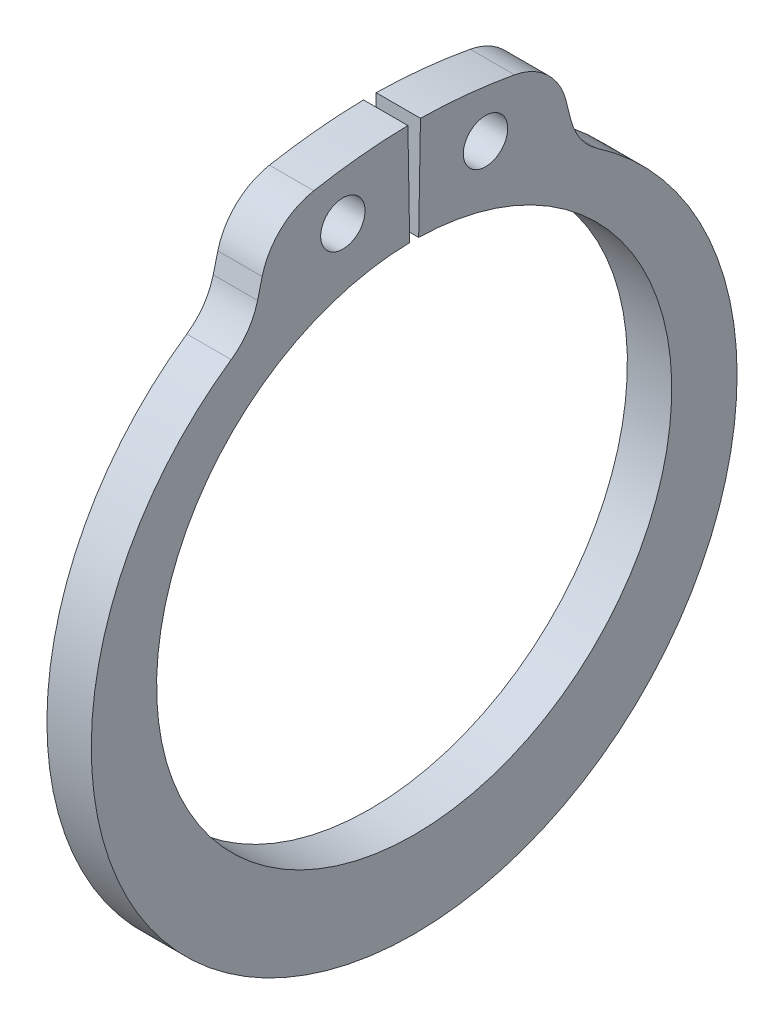
ISO-10303-21;
HEADER;
FILE_DESCRIPTION(('STEP AP214'),'2;1');
FILE_NAME('part.step','',(''),(''),'','','');
FILE_SCHEMA(('AUTOMOTIVE_DESIGN { 1 0 10303 214 1 1 1 1 }'));
ENDSEC;
DATA;
#1=APPLICATION_CONTEXT('core data for automotive mechanical design processes');
#2=APPLICATION_PROTOCOL_DEFINITION('international standard','automotive_design',2000,#1);
#3=PRODUCT_CONTEXT('',#1,'mechanical');
#4=PRODUCT('Part','Part','',(#3));
#5=PRODUCT_RELATED_PRODUCT_CATEGORY('part','',(#4));
#6=PRODUCT_DEFINITION_FORMATION('','',#4);
#7=PRODUCT_DEFINITION_CONTEXT('part definition',#1,'design');
#8=PRODUCT_DEFINITION('design','',#6,#7);
#9=PRODUCT_DEFINITION_SHAPE('','',#8);
#10=(LENGTH_UNIT() NAMED_UNIT(*) SI_UNIT(.MILLI.,.METRE.));
#11=(NAMED_UNIT(*) PLANE_ANGLE_UNIT() SI_UNIT($,.RADIAN.));
#12=(NAMED_UNIT(*) SI_UNIT($,.STERADIAN.) SOLID_ANGLE_UNIT());
#13=UNCERTAINTY_MEASURE_WITH_UNIT(LENGTH_MEASURE(1.E-05),#10,'distance_accuracy_value','');
#14=(GEOMETRIC_REPRESENTATION_CONTEXT(3) GLOBAL_UNCERTAINTY_ASSIGNED_CONTEXT((#13)) GLOBAL_UNIT_ASSIGNED_CONTEXT((#10,
#11,#12)) REPRESENTATION_CONTEXT('',''));
#15=CARTESIAN_POINT('',(0.,0.,0.));
#16=DIRECTION('',(0.,0.,1.));
#17=DIRECTION('',(1.,0.,0.));
#18=AXIS2_PLACEMENT_3D('',#15,#16,#17);
#19=CARTESIAN_POINT('',(0.9906,0.,0.));
#20=DIRECTION('',(1.,0.,0.));
#21=DIRECTION('',(0.,0.,-1.));
#22=AXIS2_PLACEMENT_3D('',#19,#20,#21);
#23=PLANE('',#22);
#24=CARTESIAN_POINT('',(0.9906,13.7386956694485,3.18562375031583));
#25=DIRECTION('',(1.,0.,0.));
#26=DIRECTION('',(0.,0.,-1.));
#27=AXIS2_PLACEMENT_3D('',#24,#25,#26);
#28=CIRCLE('',#27,0.9906);
#29=CARTESIAN_POINT('',(0.9906,13.7386956694485,2.19502375031583));
#30=VERTEX_POINT('',#29);
#31=EDGE_CURVE('E276',#30,#30,#28,.T.);
#32=ORIENTED_EDGE('',*,*,#31,.F.);
#33=EDGE_LOOP('',(#32));
#34=FACE_BOUND('',#33,.T.);
#35=CARTESIAN_POINT('',(0.9906,-9.62190277241611,-0.167950937625521));
#36=DIRECTION('',(1.,0.,0.));
#37=DIRECTION('',(0.,0.,-1.));
#38=AXIS2_PLACEMENT_3D('',#35,#36,#37);
#39=CIRCLE('',#38,25.7015684580441);
#40=CARTESIAN_POINT('',(0.9906,16.0757512122635,0.280603281179932));
#41=VERTEX_POINT('',#40);
#42=CARTESIAN_POINT('',(0.9906,15.6551175075098,4.48423854387066));
#43=VERTEX_POINT('',#42);
#44=EDGE_CURVE('E169',#41,#43,#39,.T.);
#45=ORIENTED_EDGE('',*,*,#44,.T.);
#46=CARTESIAN_POINT('',(0.9906,12.7823676845489,3.95551417836614));
#47=DIRECTION('',(1.,0.,0.));
#48=DIRECTION('',(0.,0.,-1.));
#49=AXIS2_PLACEMENT_3D('',#46,#47,#48);
#50=CIRCLE('',#49,2.921);
#51=CARTESIAN_POINT('',(0.9906,13.4890215415955,6.78974799481833));
#52=VERTEX_POINT('',#51);
#53=EDGE_CURVE('E218',#43,#52,#50,.T.);
#54=ORIENTED_EDGE('',*,*,#53,.T.);
#55=DIRECTION('',(0.,-0.970295726275997,0.241921895599664));
#56=VECTOR('',#55,1.);
#57=CARTESIAN_POINT('',(0.9906,15.2385208359464,6.35354882978227));
#58=LINE('',#57,#56);
#59=CARTESIAN_POINT('',(0.9906,12.6673759307559,6.99460725401382));
#60=VERTEX_POINT('',#59);
#61=EDGE_CURVE('E267',#52,#60,#58,.T.);
#62=ORIENTED_EDGE('',*,*,#61,.T.);
#63=CARTESIAN_POINT('',(0.9906,13.3740297878026,9.82884107046601));
#64=DIRECTION('',(1.,0.,0.));
#65=DIRECTION('',(0.,0.,-1.));
#66=AXIS2_PLACEMENT_3D('',#63,#64,#65);
#67=CIRCLE('',#66,2.921);
#68=CARTESIAN_POINT('',(0.9906,10.9672730256424,8.17361815865124));
#69=VERTEX_POINT('',#68);
#70=EDGE_CURVE('E234',#60,#69,#67,.F.);
#71=ORIENTED_EDGE('',*,*,#70,.T.);
#72=CARTESIAN_POINT('',(0.9906,-0.917477139566747,0.));
#73=DIRECTION('',(1.,0.,0.));
#74=DIRECTION('',(0.,0.,-1.));
#75=AXIS2_PLACEMENT_3D('',#72,#73,#74);
#76=CIRCLE('',#75,14.4241228604332);
#77=CARTESIAN_POINT('',(0.9906,10.9672730256424,-8.1736181586513));
#78=VERTEX_POINT('',#77);
#79=EDGE_CURVE('E259',#69,#78,#76,.T.);
#80=ORIENTED_EDGE('',*,*,#79,.T.);
#81=CARTESIAN_POINT('',(0.9906,13.3740297878025,-9.82884107046608));
#82=DIRECTION('',(1.,0.,0.));
#83=DIRECTION('',(0.,0.,-1.));
#84=AXIS2_PLACEMENT_3D('',#81,#82,#83);
#85=CIRCLE('',#84,2.921);
#86=CARTESIAN_POINT('',(0.9906,12.6673759307558,-6.99460725401391));
#87=VERTEX_POINT('',#86);
#88=EDGE_CURVE('E11',#78,#87,#85,.F.);
#89=ORIENTED_EDGE('',*,*,#88,.T.);
#90=DIRECTION('',(0.,0.970295726275991,0.241921895599687));
#91=VECTOR('',#90,1.);
#92=CARTESIAN_POINT('',(0.9906,15.2385208359464,-6.35354882978226));
#93=LINE('',#92,#91);
#94=CARTESIAN_POINT('',(0.9906,13.4890215415955,-6.78974799481836));
#95=VERTEX_POINT('',#94);
#96=EDGE_CURVE('E258',#87,#95,#93,.T.);
#97=ORIENTED_EDGE('',*,*,#96,.T.);
#98=CARTESIAN_POINT('',(0.9906,12.7823676845488,-3.95551417836619));
#99=DIRECTION('',(1.,0.,0.));
#100=DIRECTION('',(0.,0.,-1.));
#101=AXIS2_PLACEMENT_3D('',#98,#99,#100);
#102=CIRCLE('',#101,2.921);
#103=CARTESIAN_POINT('',(0.9906,15.6551175075097,-4.48423854387069));
#104=VERTEX_POINT('',#103);
#105=EDGE_CURVE('E61',#95,#104,#102,.T.);
#106=ORIENTED_EDGE('',*,*,#105,.T.);
#107=CARTESIAN_POINT('',(0.9906,-9.62190277241895,0.167950937625904));
#108=DIRECTION('',(1.,0.,0.));
#109=DIRECTION('',(0.,0.,1.));
#110=AXIS2_PLACEMENT_3D('',#107,#108,#109);
#111=CIRCLE('',#110,25.7015684580469);
#112=CARTESIAN_POINT('',(0.9906,16.0757512122635,-0.280603281179933));
#113=VERTEX_POINT('',#112);
#114=EDGE_CURVE('E262',#104,#113,#111,.T.);
#115=ORIENTED_EDGE('',*,*,#114,.T.);
#116=DIRECTION('',(0.,-0.999847695156391,0.0174524064372835));
#117=VECTOR('',#116,1.);
#118=CARTESIAN_POINT('',(0.9906,16.0757512122635,-0.280603281179932));
#119=LINE('',#118,#117);
#120=CARTESIAN_POINT('',(0.9906,11.5044475500085,-0.200810878948672));
#121=VERTEX_POINT('',#120);
#122=EDGE_CURVE('E175',#113,#121,#119,.T.);
#123=ORIENTED_EDGE('',*,*,#122,.T.);
#124=CARTESIAN_POINT('',(0.9906,0.,0.));
#125=DIRECTION('',(-1.,0.,0.));
#126=DIRECTION('',(0.,0.,-1.));
#127=AXIS2_PLACEMENT_3D('',#124,#125,#126);
#128=CIRCLE('',#127,11.5062);
#129=CARTESIAN_POINT('',(0.9906,11.5044475500085,0.200810878948672));
#130=VERTEX_POINT('',#129);
#131=EDGE_CURVE('E170',#121,#130,#128,.T.);
#132=ORIENTED_EDGE('',*,*,#131,.T.);
#133=DIRECTION('',(0.,0.999847695156391,0.0174524064372835));
#134=VECTOR('',#133,1.);
#135=CARTESIAN_POINT('',(0.9906,11.5044475500085,0.200810878948672));
#136=LINE('',#135,#134);
#137=EDGE_CURVE('E158',#130,#41,#136,.T.);
#138=ORIENTED_EDGE('',*,*,#137,.T.);
#139=EDGE_LOOP('',(#45,#54,#62,#71,#80,#89,#97,#106,#115,#123,#132,#138));
#140=FACE_BOUND('',#139,.T.);
#141=CARTESIAN_POINT('',(0.9906,13.7386956694485,-3.18562375031583));
#142=DIRECTION('',(1.,0.,0.));
#143=DIRECTION('',(0.,0.,-1.));
#144=AXIS2_PLACEMENT_3D('',#141,#142,#143);
#145=CIRCLE('',#144,0.9906);
#146=CARTESIAN_POINT('',(0.9906,13.7386956694485,-4.17622375031583));
#147=VERTEX_POINT('',#146);
#148=EDGE_CURVE('E317',#147,#147,#145,.T.);
#149=ORIENTED_EDGE('',*,*,#148,.F.);
#150=EDGE_LOOP('',(#149));
#151=FACE_BOUND('',#150,.T.);
#152=ADVANCED_FACE('F43',(#34,#140,#151),#23,.T.);
#153=CARTESIAN_POINT('',(-0.9906,0.,0.));
#154=DIRECTION('',(1.,0.,0.));
#155=DIRECTION('',(0.,0.,-1.));
#156=AXIS2_PLACEMENT_3D('',#153,#154,#155);
#157=PLANE('',#156);
#158=CARTESIAN_POINT('',(-0.9906,13.7386956694485,3.18562375031583));
#159=DIRECTION('',(1.,0.,0.));
#160=DIRECTION('',(0.,0.,-1.));
#161=AXIS2_PLACEMENT_3D('',#158,#159,#160);
#162=CIRCLE('',#161,0.9906);
#163=CARTESIAN_POINT('',(-0.9906,13.7386956694485,2.19502375031583));
#164=VERTEX_POINT('',#163);
#165=EDGE_CURVE('E313',#164,#164,#162,.T.);
#166=ORIENTED_EDGE('',*,*,#165,.T.);
#167=EDGE_LOOP('',(#166));
#168=FACE_BOUND('',#167,.T.);
#169=DIRECTION('',(0.,-0.970295726275997,0.241921895599664));
#170=VECTOR('',#169,1.);
#171=CARTESIAN_POINT('',(-0.9906,15.2385208359464,6.35354882978227));
#172=LINE('',#171,#170);
#173=CARTESIAN_POINT('',(-0.9906,13.4890215415955,6.78974799481833));
#174=VERTEX_POINT('',#173);
#175=CARTESIAN_POINT('',(-0.9906,12.6673759307559,6.99460725401382));
#176=VERTEX_POINT('',#175);
#177=EDGE_CURVE('E255',#174,#176,#172,.T.);
#178=ORIENTED_EDGE('',*,*,#177,.F.);
#179=CARTESIAN_POINT('',(-0.9906,12.7823676845489,3.95551417836614));
#180=DIRECTION('',(1.,0.,0.));
#181=DIRECTION('',(0.,0.,-1.));
#182=AXIS2_PLACEMENT_3D('',#179,#180,#181);
#183=CIRCLE('',#182,2.921);
#184=CARTESIAN_POINT('',(-0.9906,15.6551175075098,4.48423854387066));
#185=VERTEX_POINT('',#184);
#186=EDGE_CURVE('E210',#174,#185,#183,.F.);
#187=ORIENTED_EDGE('',*,*,#186,.T.);
#188=CARTESIAN_POINT('',(-0.9906,-9.62190277241611,-0.167950937625521));
#189=DIRECTION('',(1.,0.,0.));
#190=DIRECTION('',(0.,0.,-1.));
#191=AXIS2_PLACEMENT_3D('',#188,#189,#190);
#192=CIRCLE('',#191,25.7015684580441);
#193=CARTESIAN_POINT('',(-0.9906,16.0757512122635,0.280603281179932));
#194=VERTEX_POINT('',#193);
#195=EDGE_CURVE('E279',#194,#185,#192,.T.);
#196=ORIENTED_EDGE('',*,*,#195,.F.);
#197=DIRECTION('',(0.,0.999847695156391,0.0174524064372835));
#198=VECTOR('',#197,1.);
#199=CARTESIAN_POINT('',(-0.9906,11.5044475500085,0.200810878948672));
#200=LINE('',#199,#198);
#201=CARTESIAN_POINT('',(-0.9906,11.5044475500085,0.200810878948672));
#202=VERTEX_POINT('',#201);
#203=EDGE_CURVE('E275',#202,#194,#200,.T.);
#204=ORIENTED_EDGE('',*,*,#203,.F.);
#205=CARTESIAN_POINT('',(-0.9906,0.,0.));
#206=DIRECTION('',(-1.,0.,0.));
#207=DIRECTION('',(0.,0.,-1.));
#208=AXIS2_PLACEMENT_3D('',#205,#206,#207);
#209=CIRCLE('',#208,11.5062);
#210=CARTESIAN_POINT('',(-0.9906,11.5044475500085,-0.200810878948672));
#211=VERTEX_POINT('',#210);
#212=EDGE_CURVE('E184',#211,#202,#209,.T.);
#213=ORIENTED_EDGE('',*,*,#212,.F.);
#214=DIRECTION('',(0.,-0.999847695156391,0.0174524064372835));
#215=VECTOR('',#214,1.);
#216=CARTESIAN_POINT('',(-0.9906,16.0757512122635,-0.280603281179932));
#217=LINE('',#216,#215);
#218=CARTESIAN_POINT('',(-0.9906,16.0757512122635,-0.280603281179933));
#219=VERTEX_POINT('',#218);
#220=EDGE_CURVE('E180',#219,#211,#217,.T.);
#221=ORIENTED_EDGE('',*,*,#220,.F.);
#222=CARTESIAN_POINT('',(-0.9906,-9.62190277241895,0.167950937625904));
#223=DIRECTION('',(1.,0.,0.));
#224=DIRECTION('',(0.,0.,1.));
#225=AXIS2_PLACEMENT_3D('',#222,#223,#224);
#226=CIRCLE('',#225,25.7015684580469);
#227=CARTESIAN_POINT('',(-0.9906,15.6551175075097,-4.48423854387069));
#228=VERTEX_POINT('',#227);
#229=EDGE_CURVE('E288',#228,#219,#226,.T.);
#230=ORIENTED_EDGE('',*,*,#229,.F.);
#231=CARTESIAN_POINT('',(-0.9906,12.7823676845488,-3.95551417836619));
#232=DIRECTION('',(1.,0.,0.));
#233=DIRECTION('',(0.,0.,-1.));
#234=AXIS2_PLACEMENT_3D('',#231,#232,#233);
#235=CIRCLE('',#234,2.921);
#236=CARTESIAN_POINT('',(-0.9906,13.4890215415955,-6.78974799481836));
#237=VERTEX_POINT('',#236);
#238=EDGE_CURVE('E207',#228,#237,#235,.F.);
#239=ORIENTED_EDGE('',*,*,#238,.T.);
#240=DIRECTION('',(0.,0.970295726275991,0.241921895599687));
#241=VECTOR('',#240,1.);
#242=CARTESIAN_POINT('',(-0.9906,15.2385208359464,-6.35354882978226));
#243=LINE('',#242,#241);
#244=CARTESIAN_POINT('',(-0.9906,12.6673759307558,-6.99460725401391));
#245=VERTEX_POINT('',#244);
#246=EDGE_CURVE('E245',#245,#237,#243,.T.);
#247=ORIENTED_EDGE('',*,*,#246,.F.);
#248=CARTESIAN_POINT('',(-0.9906,13.3740297878025,-9.82884107046608));
#249=DIRECTION('',(1.,0.,0.));
#250=DIRECTION('',(0.,0.,-1.));
#251=AXIS2_PLACEMENT_3D('',#248,#249,#250);
#252=CIRCLE('',#251,2.921);
#253=CARTESIAN_POINT('',(-0.9906,10.9672730256424,-8.1736181586513));
#254=VERTEX_POINT('',#253);
#255=EDGE_CURVE('E52',#245,#254,#252,.T.);
#256=ORIENTED_EDGE('',*,*,#255,.T.);
#257=CARTESIAN_POINT('',(-0.9906,-0.917477139566747,0.));
#258=DIRECTION('',(1.,0.,0.));
#259=DIRECTION('',(0.,0.,-1.));
#260=AXIS2_PLACEMENT_3D('',#257,#258,#259);
#261=CIRCLE('',#260,14.4241228604332);
#262=CARTESIAN_POINT('',(-0.9906,10.9672730256424,8.17361815865124));
#263=VERTEX_POINT('',#262);
#264=EDGE_CURVE('E244',#263,#254,#261,.T.);
#265=ORIENTED_EDGE('',*,*,#264,.F.);
#266=CARTESIAN_POINT('',(-0.9906,13.3740297878026,9.82884107046601));
#267=DIRECTION('',(1.,0.,0.));
#268=DIRECTION('',(0.,0.,-1.));
#269=AXIS2_PLACEMENT_3D('',#266,#267,#268);
#270=CIRCLE('',#269,2.921);
#271=EDGE_CURVE('E231',#263,#176,#270,.T.);
#272=ORIENTED_EDGE('',*,*,#271,.T.);
#273=EDGE_LOOP('',(#178,#187,#196,#204,#213,#221,#230,#239,#247,#256,#265,#272));
#274=FACE_BOUND('',#273,.T.);
#275=CARTESIAN_POINT('',(-0.9906,13.7386956694485,-3.18562375031583));
#276=DIRECTION('',(1.,0.,0.));
#277=DIRECTION('',(0.,0.,-1.));
#278=AXIS2_PLACEMENT_3D('',#275,#276,#277);
#279=CIRCLE('',#278,0.9906);
#280=CARTESIAN_POINT('',(-0.9906,13.7386956694485,-4.17622375031583));
#281=VERTEX_POINT('',#280);
#282=EDGE_CURVE('E321',#281,#281,#279,.T.);
#283=ORIENTED_EDGE('',*,*,#282,.T.);
#284=EDGE_LOOP('',(#283));
#285=FACE_BOUND('',#284,.T.);
#286=ADVANCED_FACE('F242',(#168,#274,#285),#157,.F.);
#287=CARTESIAN_POINT('',(0.9906,0.,0.));
#288=DIRECTION('',(-1.,0.,0.));
#289=DIRECTION('',(0.,0.,1.));
#290=AXIS2_PLACEMENT_3D('',#287,#288,#289);
#291=CYLINDRICAL_SURFACE('',#290,11.5062);
#292=ORIENTED_EDGE('',*,*,#212,.T.);
#293=DIRECTION('',(-1.,0.,0.));
#294=VECTOR('',#293,1.);
#295=CARTESIAN_POINT('',(0.9906,11.5044475500085,0.200810878948672));
#296=LINE('',#295,#294);
#297=EDGE_CURVE('E162',#130,#202,#296,.T.);
#298=ORIENTED_EDGE('',*,*,#297,.F.);
#299=ORIENTED_EDGE('',*,*,#131,.F.);
#300=DIRECTION('',(-1.,0.,0.));
#301=VECTOR('',#300,1.);
#302=CARTESIAN_POINT('',(0.9906,11.5044475500085,-0.200810878948672));
#303=LINE('',#302,#301);
#304=EDGE_CURVE('E272',#121,#211,#303,.T.);
#305=ORIENTED_EDGE('',*,*,#304,.T.);
#306=EDGE_LOOP('',(#292,#298,#299,#305));
#307=FACE_BOUND('',#306,.T.);
#308=ADVANCED_FACE('F182',(#307),#291,.F.);
#309=CARTESIAN_POINT('',(0.9906,11.5044475500085,0.200810878948672));
#310=DIRECTION('',(0.,-0.0174524064372835,0.999847695156391));
#311=DIRECTION('',(0.,-0.999847695156391,-0.0174524064372835));
#312=AXIS2_PLACEMENT_3D('',#309,#310,#311);
#313=PLANE('',#312);
#314=ORIENTED_EDGE('',*,*,#203,.T.);
#315=DIRECTION('',(-1.,0.,0.));
#316=VECTOR('',#315,1.);
#317=CARTESIAN_POINT('',(0.9906,16.0757512122635,0.280603281179932));
#318=LINE('',#317,#316);
#319=EDGE_CURVE('E165',#41,#194,#318,.T.);
#320=ORIENTED_EDGE('',*,*,#319,.F.);
#321=ORIENTED_EDGE('',*,*,#137,.F.);
#322=ORIENTED_EDGE('',*,*,#297,.T.);
#323=EDGE_LOOP('',(#314,#320,#321,#322));
#324=FACE_BOUND('',#323,.T.);
#325=ADVANCED_FACE('F160',(#324),#313,.F.);
#326=CARTESIAN_POINT('',(0.9906,-9.62190277241611,-0.167950937625521));
#327=DIRECTION('',(-1.,0.,0.));
#328=DIRECTION('',(0.,0.,1.));
#329=AXIS2_PLACEMENT_3D('',#326,#327,#328);
#330=CYLINDRICAL_SURFACE('',#329,25.7015684580441);
#331=ORIENTED_EDGE('',*,*,#195,.T.);
#332=DIRECTION('',(-1.,0.,0.));
#333=VECTOR('',#332,1.);
#334=CARTESIAN_POINT('',(0.9906,15.6551175075098,4.48423854387066));
#335=LINE('',#334,#333);
#336=EDGE_CURVE('E213',#185,#43,#335,.F.);
#337=ORIENTED_EDGE('',*,*,#336,.T.);
#338=ORIENTED_EDGE('',*,*,#44,.F.);
#339=ORIENTED_EDGE('',*,*,#319,.T.);
#340=EDGE_LOOP('',(#331,#337,#338,#339));
#341=FACE_BOUND('',#340,.T.);
#342=ADVANCED_FACE('F304',(#341),#330,.T.);
#343=CARTESIAN_POINT('',(0.9906,15.2385208359464,6.35354882978227));
#344=DIRECTION('',(0.,-0.241921895599664,-0.970295726275997));
#345=DIRECTION('',(0.,0.970295726275997,-0.241921895599664));
#346=AXIS2_PLACEMENT_3D('',#343,#344,#345);
#347=PLANE('',#346);
#348=ORIENTED_EDGE('',*,*,#177,.T.);
#349=DIRECTION('',(1.,0.,0.));
#350=VECTOR('',#349,1.);
#351=CARTESIAN_POINT('',(0.9906,12.6673759307559,6.99460725401382));
#352=LINE('',#351,#350);
#353=EDGE_CURVE('E204',#176,#60,#352,.T.);
#354=ORIENTED_EDGE('',*,*,#353,.T.);
#355=ORIENTED_EDGE('',*,*,#61,.F.);
#356=DIRECTION('',(-1.,0.,0.));
#357=VECTOR('',#356,1.);
#358=CARTESIAN_POINT('',(0.9906,13.4890215415955,6.78974799481833));
#359=LINE('',#358,#357);
#360=EDGE_CURVE('E200',#52,#174,#359,.T.);
#361=ORIENTED_EDGE('',*,*,#360,.T.);
#362=EDGE_LOOP('',(#348,#354,#355,#361));
#363=FACE_BOUND('',#362,.T.);
#364=ADVANCED_FACE('F352',(#363),#347,.F.);
#365=CARTESIAN_POINT('',(0.9906,-0.917477139566747,0.));
#366=DIRECTION('',(-1.,0.,0.));
#367=DIRECTION('',(0.,0.,1.));
#368=AXIS2_PLACEMENT_3D('',#365,#366,#367);
#369=CYLINDRICAL_SURFACE('',#368,14.4241228604332);
#370=ORIENTED_EDGE('',*,*,#79,.F.);
#371=DIRECTION('',(-1.,0.,0.));
#372=VECTOR('',#371,1.);
#373=CARTESIAN_POINT('',(0.9906,10.9672730256424,8.17361815865124));
#374=LINE('',#373,#372);
#375=EDGE_CURVE('E190',#69,#263,#374,.T.);
#376=ORIENTED_EDGE('',*,*,#375,.T.);
#377=ORIENTED_EDGE('',*,*,#264,.T.);
#378=DIRECTION('',(-1.,0.,0.));
#379=VECTOR('',#378,1.);
#380=CARTESIAN_POINT('',(0.9906,10.9672730256424,-8.1736181586513));
#381=LINE('',#380,#379);
#382=EDGE_CURVE('E186',#254,#78,#381,.F.);
#383=ORIENTED_EDGE('',*,*,#382,.T.);
#384=EDGE_LOOP('',(#370,#376,#377,#383));
#385=FACE_BOUND('',#384,.T.);
#386=ADVANCED_FACE('F251',(#385),#369,.T.);
#387=CARTESIAN_POINT('',(0.9906,15.2385208359464,-6.35354882978226));
#388=DIRECTION('',(0.,-0.241921895599687,0.970295726275992));
#389=DIRECTION('',(0.,-0.970295726275992,-0.241921895599687));
#390=AXIS2_PLACEMENT_3D('',#387,#388,#389);
#391=PLANE('',#390);
#392=ORIENTED_EDGE('',*,*,#246,.T.);
#393=DIRECTION('',(-1.,0.,0.));
#394=VECTOR('',#393,1.);
#395=CARTESIAN_POINT('',(0.9906,13.4890215415955,-6.78974799481836));
#396=LINE('',#395,#394);
#397=EDGE_CURVE('E72',#237,#95,#396,.F.);
#398=ORIENTED_EDGE('',*,*,#397,.T.);
#399=ORIENTED_EDGE('',*,*,#96,.F.);
#400=DIRECTION('',(1.,0.,0.));
#401=VECTOR('',#400,1.);
#402=CARTESIAN_POINT('',(-0.9906,12.6673759307558,-6.99460725401391));
#403=LINE('',#402,#401);
#404=EDGE_CURVE('E225',#87,#245,#403,.F.);
#405=ORIENTED_EDGE('',*,*,#404,.T.);
#406=EDGE_LOOP('',(#392,#398,#399,#405));
#407=FACE_BOUND('',#406,.T.);
#408=ADVANCED_FACE('F260',(#407),#391,.F.);
#409=CARTESIAN_POINT('',(0.9906,-9.62190277241895,0.167950937625904));
#410=DIRECTION('',(-1.,0.,0.));
#411=DIRECTION('',(0.,0.,1.));
#412=AXIS2_PLACEMENT_3D('',#409,#410,#411);
#413=CYLINDRICAL_SURFACE('',#412,25.7015684580469);
#414=ORIENTED_EDGE('',*,*,#114,.F.);
#415=DIRECTION('',(-1.,0.,0.));
#416=VECTOR('',#415,1.);
#417=CARTESIAN_POINT('',(0.9906,15.6551175075097,-4.48423854387069));
#418=LINE('',#417,#416);
#419=EDGE_CURVE('E221',#104,#228,#418,.T.);
#420=ORIENTED_EDGE('',*,*,#419,.T.);
#421=ORIENTED_EDGE('',*,*,#229,.T.);
#422=DIRECTION('',(-1.,0.,0.));
#423=VECTOR('',#422,1.);
#424=CARTESIAN_POINT('',(0.9906,16.0757512122635,-0.280603281179933));
#425=LINE('',#424,#423);
#426=EDGE_CURVE('E193',#113,#219,#425,.T.);
#427=ORIENTED_EDGE('',*,*,#426,.F.);
#428=EDGE_LOOP('',(#414,#420,#421,#427));
#429=FACE_BOUND('',#428,.T.);
#430=ADVANCED_FACE('F345',(#429),#413,.T.);
#431=CARTESIAN_POINT('',(0.9906,16.0757512122635,-0.280603281179932));
#432=DIRECTION('',(0.,-0.0174524064372835,-0.999847695156391));
#433=DIRECTION('',(0.,0.999847695156391,-0.0174524064372835));
#434=AXIS2_PLACEMENT_3D('',#431,#432,#433);
#435=PLANE('',#434);
#436=ORIENTED_EDGE('',*,*,#220,.T.);
#437=ORIENTED_EDGE('',*,*,#304,.F.);
#438=ORIENTED_EDGE('',*,*,#122,.F.);
#439=ORIENTED_EDGE('',*,*,#426,.T.);
#440=EDGE_LOOP('',(#436,#437,#438,#439));
#441=FACE_BOUND('',#440,.T.);
#442=ADVANCED_FACE('F299',(#441),#435,.F.);
#443=CARTESIAN_POINT('',(0.9906,13.7386956694485,3.18562375031583));
#444=DIRECTION('',(-1.,0.,0.));
#445=DIRECTION('',(0.,0.,1.));
#446=AXIS2_PLACEMENT_3D('',#443,#444,#445);
#447=CYLINDRICAL_SURFACE('',#446,0.9906);
#448=ORIENTED_EDGE('',*,*,#31,.T.);
#449=EDGE_LOOP('',(#448));
#450=FACE_BOUND('',#449,.T.);
#451=ORIENTED_EDGE('',*,*,#165,.F.);
#452=EDGE_LOOP('',(#451));
#453=FACE_BOUND('',#452,.T.);
#454=ADVANCED_FACE('F340',(#450,#453),#447,.F.);
#455=CARTESIAN_POINT('',(0.9906,13.7386956694485,-3.18562375031583));
#456=DIRECTION('',(-1.,0.,0.));
#457=DIRECTION('',(0.,0.,1.));
#458=AXIS2_PLACEMENT_3D('',#455,#456,#457);
#459=CYLINDRICAL_SURFACE('',#458,0.9906);
#460=ORIENTED_EDGE('',*,*,#148,.T.);
#461=EDGE_LOOP('',(#460));
#462=FACE_BOUND('',#461,.T.);
#463=ORIENTED_EDGE('',*,*,#282,.F.);
#464=EDGE_LOOP('',(#463));
#465=FACE_BOUND('',#464,.T.);
#466=ADVANCED_FACE('F328',(#462,#465),#459,.F.);
#467=CARTESIAN_POINT('',(0.9906,13.3740297878026,9.82884107046601));
#468=DIRECTION('',(-1.,0.,0.));
#469=DIRECTION('',(0.,0.,1.));
#470=AXIS2_PLACEMENT_3D('',#467,#468,#469);
#471=CYLINDRICAL_SURFACE('',#470,2.921);
#472=ORIENTED_EDGE('',*,*,#70,.F.);
#473=ORIENTED_EDGE('',*,*,#353,.F.);
#474=ORIENTED_EDGE('',*,*,#271,.F.);
#475=ORIENTED_EDGE('',*,*,#375,.F.);
#476=EDGE_LOOP('',(#472,#473,#474,#475));
#477=FACE_BOUND('',#476,.T.);
#478=ADVANCED_FACE('F362',(#477),#471,.F.);
#479=CARTESIAN_POINT('',(0.9906,12.7823676845489,3.95551417836614));
#480=DIRECTION('',(-1.,0.,0.));
#481=DIRECTION('',(0.,0.,1.));
#482=AXIS2_PLACEMENT_3D('',#479,#480,#481);
#483=CYLINDRICAL_SURFACE('',#482,2.921);
#484=ORIENTED_EDGE('',*,*,#53,.F.);
#485=ORIENTED_EDGE('',*,*,#336,.F.);
#486=ORIENTED_EDGE('',*,*,#186,.F.);
#487=ORIENTED_EDGE('',*,*,#360,.F.);
#488=EDGE_LOOP('',(#484,#485,#486,#487));
#489=FACE_BOUND('',#488,.T.);
#490=ADVANCED_FACE('F365',(#489),#483,.T.);
#491=CARTESIAN_POINT('',(0.9906,12.7823676845488,-3.95551417836619));
#492=DIRECTION('',(-1.,0.,0.));
#493=DIRECTION('',(0.,0.,1.));
#494=AXIS2_PLACEMENT_3D('',#491,#492,#493);
#495=CYLINDRICAL_SURFACE('',#494,2.921);
#496=ORIENTED_EDGE('',*,*,#105,.F.);
#497=ORIENTED_EDGE('',*,*,#397,.F.);
#498=ORIENTED_EDGE('',*,*,#238,.F.);
#499=ORIENTED_EDGE('',*,*,#419,.F.);
#500=EDGE_LOOP('',(#496,#497,#498,#499));
#501=FACE_BOUND('',#500,.T.);
#502=ADVANCED_FACE('F368',(#501),#495,.T.);
#503=CARTESIAN_POINT('',(0.9906,13.3740297878025,-9.82884107046608));
#504=DIRECTION('',(-1.,0.,0.));
#505=DIRECTION('',(0.,0.,1.));
#506=AXIS2_PLACEMENT_3D('',#503,#504,#505);
#507=CYLINDRICAL_SURFACE('',#506,2.921);
#508=ORIENTED_EDGE('',*,*,#88,.F.);
#509=ORIENTED_EDGE('',*,*,#382,.F.);
#510=ORIENTED_EDGE('',*,*,#255,.F.);
#511=ORIENTED_EDGE('',*,*,#404,.F.);
#512=EDGE_LOOP('',(#508,#509,#510,#511));
#513=FACE_BOUND('',#512,.T.);
#514=ADVANCED_FACE('F45',(#513),#507,.F.);
#515=CLOSED_SHELL('',(#152,#286,#308,#325,#342,#364,#386,#408,#430,#442,#454,#466,#478,#490,
#502,#514));
#516=MANIFOLD_SOLID_BREP('B2',#515);
#517=ADVANCED_BREP_SHAPE_REPRESENTATION('',(#18,#516),#14);
#518=SHAPE_DEFINITION_REPRESENTATION(#9,#517);
ENDSEC;
END-ISO-10303-21;
